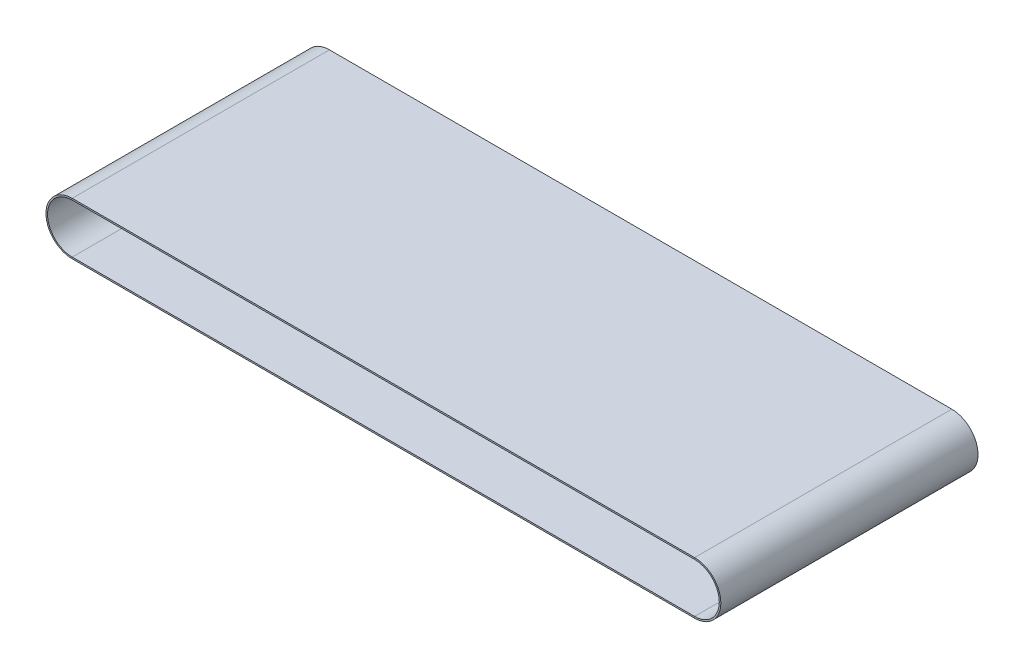
ISO-10303-21;
HEADER;
FILE_DESCRIPTION(('STEP AP214'),'2;1');
FILE_NAME('part.step','',(''),(''),'','','');
FILE_SCHEMA(('AUTOMOTIVE_DESIGN { 1 0 10303 214 1 1 1 1 }'));
ENDSEC;
DATA;
#1=APPLICATION_CONTEXT('core data for automotive mechanical design processes');
#2=APPLICATION_PROTOCOL_DEFINITION('international standard','automotive_design',2000,#1);
#3=PRODUCT_CONTEXT('',#1,'mechanical');
#4=PRODUCT('Part','Part','',(#3));
#5=PRODUCT_RELATED_PRODUCT_CATEGORY('part','',(#4));
#6=PRODUCT_DEFINITION_FORMATION('','',#4);
#7=PRODUCT_DEFINITION_CONTEXT('part definition',#1,'design');
#8=PRODUCT_DEFINITION('design','',#6,#7);
#9=PRODUCT_DEFINITION_SHAPE('','',#8);
#10=(LENGTH_UNIT() NAMED_UNIT(*) SI_UNIT(.MILLI.,.METRE.));
#11=(NAMED_UNIT(*) PLANE_ANGLE_UNIT() SI_UNIT($,.RADIAN.));
#12=(NAMED_UNIT(*) SI_UNIT($,.STERADIAN.) SOLID_ANGLE_UNIT());
#13=UNCERTAINTY_MEASURE_WITH_UNIT(LENGTH_MEASURE(1.E-05),#10,'distance_accuracy_value','');
#14=(GEOMETRIC_REPRESENTATION_CONTEXT(3) GLOBAL_UNCERTAINTY_ASSIGNED_CONTEXT((#13)) GLOBAL_UNIT_ASSIGNED_CONTEXT((#10,
#11,#12)) REPRESENTATION_CONTEXT('',''));
#15=CARTESIAN_POINT('',(0.,0.,0.));
#16=DIRECTION('',(0.,0.,1.));
#17=DIRECTION('',(1.,0.,0.));
#18=AXIS2_PLACEMENT_3D('',#15,#16,#17);
#19=CARTESIAN_POINT('',(-605.,0.,0.));
#20=DIRECTION('',(0.,0.,-1.));
#21=DIRECTION('',(-1.,0.,0.));
#22=AXIS2_PLACEMENT_3D('',#19,#20,#21);
#23=CYLINDRICAL_SURFACE('',#22,24.);
#24=CARTESIAN_POINT('',(-605.,0.,125.));
#25=DIRECTION('',(0.,0.,-1.));
#26=DIRECTION('',(0.,-1.,0.));
#27=AXIS2_PLACEMENT_3D('',#24,#25,#26);
#28=CIRCLE('',#27,24.);
#29=CARTESIAN_POINT('',(-605.,-24.,125.));
#30=VERTEX_POINT('',#29);
#31=CARTESIAN_POINT('',(-605.,24.,125.));
#32=VERTEX_POINT('',#31);
#33=EDGE_CURVE('E11',#30,#32,#28,.T.);
#34=ORIENTED_EDGE('',*,*,#33,.F.);
#35=DIRECTION('',(0.,0.,-1.));
#36=VECTOR('',#35,1.);
#37=CARTESIAN_POINT('',(-605.,-24.,125.));
#38=LINE('',#37,#36);
#39=CARTESIAN_POINT('',(-605.,-24.,-125.));
#40=VERTEX_POINT('',#39);
#41=EDGE_CURVE('E37',#30,#40,#38,.T.);
#42=ORIENTED_EDGE('',*,*,#41,.T.);
#43=CARTESIAN_POINT('',(-605.,0.,-125.));
#44=DIRECTION('',(0.,0.,-1.));
#45=DIRECTION('',(0.,-1.,0.));
#46=AXIS2_PLACEMENT_3D('',#43,#44,#45);
#47=CIRCLE('',#46,24.);
#48=CARTESIAN_POINT('',(-605.,24.,-125.));
#49=VERTEX_POINT('',#48);
#50=EDGE_CURVE('E122',#40,#49,#47,.T.);
#51=ORIENTED_EDGE('',*,*,#50,.T.);
#52=DIRECTION('',(0.,0.,-1.));
#53=VECTOR('',#52,1.);
#54=CARTESIAN_POINT('',(-605.,24.,125.));
#55=LINE('',#54,#53);
#56=EDGE_CURVE('E125',#32,#49,#55,.T.);
#57=ORIENTED_EDGE('',*,*,#56,.F.);
#58=EDGE_LOOP('',(#34,#42,#51,#57));
#59=FACE_BOUND('',#58,.T.);
#60=ADVANCED_FACE('F34',(#59),#23,.F.);
#61=CARTESIAN_POINT('',(-605.,-24.,125.));
#62=DIRECTION('',(0.,0.,1.));
#63=DIRECTION('',(1.,0.,0.));
#64=AXIS2_PLACEMENT_3D('',#61,#62,#63);
#65=PLANE('',#64);
#66=CARTESIAN_POINT('',(-605.,0.,125.));
#67=DIRECTION('',(0.,0.,-1.));
#68=DIRECTION('',(0.,-1.,0.));
#69=AXIS2_PLACEMENT_3D('',#66,#67,#68);
#70=CIRCLE('',#69,25.5);
#71=CARTESIAN_POINT('',(-605.,-25.5,125.));
#72=VERTEX_POINT('',#71);
#73=CARTESIAN_POINT('',(-605.,25.5,125.));
#74=VERTEX_POINT('',#73);
#75=EDGE_CURVE('E42',#72,#74,#70,.T.);
#76=ORIENTED_EDGE('',*,*,#75,.F.);
#77=DIRECTION('',(0.,1.,0.));
#78=VECTOR('',#77,1.);
#79=CARTESIAN_POINT('',(-605.,-24.,125.));
#80=LINE('',#79,#78);
#81=EDGE_CURVE('E192',#72,#30,#80,.T.);
#82=ORIENTED_EDGE('',*,*,#81,.T.);
#83=ORIENTED_EDGE('',*,*,#33,.T.);
#84=DIRECTION('',(0.,-1.,0.));
#85=VECTOR('',#84,1.);
#86=CARTESIAN_POINT('',(-605.,24.,125.));
#87=LINE('',#86,#85);
#88=EDGE_CURVE('E150',#74,#32,#87,.T.);
#89=ORIENTED_EDGE('',*,*,#88,.F.);
#90=EDGE_LOOP('',(#76,#82,#83,#89));
#91=FACE_BOUND('',#90,.T.);
#92=ADVANCED_FACE('F216',(#91),#65,.T.);
#93=CARTESIAN_POINT('',(-605.,0.,0.));
#94=DIRECTION('',(0.,0.,-1.));
#95=DIRECTION('',(-1.,0.,0.));
#96=AXIS2_PLACEMENT_3D('',#93,#94,#95);
#97=CYLINDRICAL_SURFACE('',#96,25.5);
#98=CARTESIAN_POINT('',(-605.,0.,-125.));
#99=DIRECTION('',(0.,0.,-1.));
#100=DIRECTION('',(0.,-1.,0.));
#101=AXIS2_PLACEMENT_3D('',#98,#99,#100);
#102=CIRCLE('',#101,25.5);
#103=CARTESIAN_POINT('',(-605.,-25.5,-125.));
#104=VERTEX_POINT('',#103);
#105=CARTESIAN_POINT('',(-605.,25.5,-125.));
#106=VERTEX_POINT('',#105);
#107=EDGE_CURVE('E131',#104,#106,#102,.T.);
#108=ORIENTED_EDGE('',*,*,#107,.F.);
#109=DIRECTION('',(0.,0.,1.));
#110=VECTOR('',#109,1.);
#111=CARTESIAN_POINT('',(-605.,-25.5,-125.));
#112=LINE('',#111,#110);
#113=EDGE_CURVE('E176',#104,#72,#112,.T.);
#114=ORIENTED_EDGE('',*,*,#113,.T.);
#115=ORIENTED_EDGE('',*,*,#75,.T.);
#116=DIRECTION('',(0.,0.,1.));
#117=VECTOR('',#116,1.);
#118=CARTESIAN_POINT('',(-605.,25.5,-125.));
#119=LINE('',#118,#117);
#120=EDGE_CURVE('E154',#106,#74,#119,.T.);
#121=ORIENTED_EDGE('',*,*,#120,.F.);
#122=EDGE_LOOP('',(#108,#114,#115,#121));
#123=FACE_BOUND('',#122,.T.);
#124=ADVANCED_FACE('F221',(#123),#97,.T.);
#125=CARTESIAN_POINT('',(0.,-24.,125.));
#126=DIRECTION('',(0.,1.,0.));
#127=DIRECTION('',(0.,0.,1.));
#128=AXIS2_PLACEMENT_3D('',#125,#126,#127);
#129=PLANE('',#128);
#130=ORIENTED_EDGE('',*,*,#41,.F.);
#131=DIRECTION('',(-1.,0.,0.));
#132=VECTOR('',#131,1.);
#133=CARTESIAN_POINT('',(0.,-24.,125.));
#134=LINE('',#133,#132);
#135=CARTESIAN_POINT('',(0.,-24.,125.));
#136=VERTEX_POINT('',#135);
#137=EDGE_CURVE('E78',#136,#30,#134,.T.);
#138=ORIENTED_EDGE('',*,*,#137,.F.);
#139=DIRECTION('',(0.,0.,-1.));
#140=VECTOR('',#139,1.);
#141=CARTESIAN_POINT('',(0.,-24.,125.));
#142=LINE('',#141,#140);
#143=CARTESIAN_POINT('',(0.,-24.,-125.));
#144=VERTEX_POINT('',#143);
#145=EDGE_CURVE('E179',#136,#144,#142,.T.);
#146=ORIENTED_EDGE('',*,*,#145,.T.);
#147=DIRECTION('',(-1.,0.,0.));
#148=VECTOR('',#147,1.);
#149=CARTESIAN_POINT('',(0.,-24.,-125.));
#150=LINE('',#149,#148);
#151=EDGE_CURVE('E174',#144,#40,#150,.T.);
#152=ORIENTED_EDGE('',*,*,#151,.T.);
#153=EDGE_LOOP('',(#130,#138,#146,#152));
#154=FACE_BOUND('',#153,.T.);
#155=ADVANCED_FACE('F205',(#154),#129,.T.);
#156=CARTESIAN_POINT('',(0.,-24.,125.));
#157=DIRECTION('',(0.,0.,1.));
#158=DIRECTION('',(1.,0.,0.));
#159=AXIS2_PLACEMENT_3D('',#156,#157,#158);
#160=PLANE('',#159);
#161=ORIENTED_EDGE('',*,*,#137,.T.);
#162=ORIENTED_EDGE('',*,*,#81,.F.);
#163=DIRECTION('',(-1.,0.,0.));
#164=VECTOR('',#163,1.);
#165=CARTESIAN_POINT('',(0.,-25.5,125.));
#166=LINE('',#165,#164);
#167=CARTESIAN_POINT('',(0.,-25.5,125.));
#168=VERTEX_POINT('',#167);
#169=EDGE_CURVE('E87',#168,#72,#166,.T.);
#170=ORIENTED_EDGE('',*,*,#169,.F.);
#171=DIRECTION('',(0.,1.,0.));
#172=VECTOR('',#171,1.);
#173=CARTESIAN_POINT('',(0.,-24.,125.));
#174=LINE('',#173,#172);
#175=EDGE_CURVE('E188',#168,#136,#174,.T.);
#176=ORIENTED_EDGE('',*,*,#175,.T.);
#177=EDGE_LOOP('',(#161,#162,#170,#176));
#178=FACE_BOUND('',#177,.T.);
#179=ADVANCED_FACE('F215',(#178),#160,.T.);
#180=CARTESIAN_POINT('',(0.,-25.5,-125.));
#181=DIRECTION('',(0.,-1.,0.));
#182=DIRECTION('',(0.,0.,-1.));
#183=AXIS2_PLACEMENT_3D('',#180,#181,#182);
#184=PLANE('',#183);
#185=ORIENTED_EDGE('',*,*,#169,.T.);
#186=ORIENTED_EDGE('',*,*,#113,.F.);
#187=DIRECTION('',(-1.,0.,0.));
#188=VECTOR('',#187,1.);
#189=CARTESIAN_POINT('',(0.,-25.5,-125.));
#190=LINE('',#189,#188);
#191=CARTESIAN_POINT('',(0.,-25.5,-125.));
#192=VERTEX_POINT('',#191);
#193=EDGE_CURVE('E95',#192,#104,#190,.T.);
#194=ORIENTED_EDGE('',*,*,#193,.F.);
#195=DIRECTION('',(0.,0.,1.));
#196=VECTOR('',#195,1.);
#197=CARTESIAN_POINT('',(0.,-25.5,-125.));
#198=LINE('',#197,#196);
#199=EDGE_CURVE('E168',#192,#168,#198,.T.);
#200=ORIENTED_EDGE('',*,*,#199,.T.);
#201=EDGE_LOOP('',(#185,#186,#194,#200));
#202=FACE_BOUND('',#201,.T.);
#203=ADVANCED_FACE('F222',(#202),#184,.T.);
#204=CARTESIAN_POINT('',(0.,-24.,-125.));
#205=DIRECTION('',(0.,0.,-1.));
#206=DIRECTION('',(-1.,0.,0.));
#207=AXIS2_PLACEMENT_3D('',#204,#205,#206);
#208=PLANE('',#207);
#209=ORIENTED_EDGE('',*,*,#193,.T.);
#210=DIRECTION('',(0.,-1.,0.));
#211=VECTOR('',#210,1.);
#212=CARTESIAN_POINT('',(-605.,-24.,-125.));
#213=LINE('',#212,#211);
#214=EDGE_CURVE('E172',#40,#104,#213,.T.);
#215=ORIENTED_EDGE('',*,*,#214,.F.);
#216=ORIENTED_EDGE('',*,*,#151,.F.);
#217=DIRECTION('',(0.,-1.,0.));
#218=VECTOR('',#217,1.);
#219=CARTESIAN_POINT('',(0.,-24.,-125.));
#220=LINE('',#219,#218);
#221=EDGE_CURVE('E163',#144,#192,#220,.T.);
#222=ORIENTED_EDGE('',*,*,#221,.T.);
#223=EDGE_LOOP('',(#209,#215,#216,#222));
#224=FACE_BOUND('',#223,.T.);
#225=ADVANCED_FACE('F223',(#224),#208,.T.);
#226=CARTESIAN_POINT('',(0.,0.,0.));
#227=DIRECTION('',(0.,0.,-1.));
#228=DIRECTION('',(-1.,0.,0.));
#229=AXIS2_PLACEMENT_3D('',#226,#227,#228);
#230=CYLINDRICAL_SURFACE('',#229,24.);
#231=ORIENTED_EDGE('',*,*,#145,.F.);
#232=CARTESIAN_POINT('',(0.,0.,125.));
#233=DIRECTION('',(0.,0.,-1.));
#234=DIRECTION('',(0.,1.,0.));
#235=AXIS2_PLACEMENT_3D('',#232,#233,#234);
#236=CIRCLE('',#235,24.);
#237=CARTESIAN_POINT('',(0.,24.,125.));
#238=VERTEX_POINT('',#237);
#239=EDGE_CURVE('E198',#238,#136,#236,.T.);
#240=ORIENTED_EDGE('',*,*,#239,.F.);
#241=DIRECTION('',(0.,0.,-1.));
#242=VECTOR('',#241,1.);
#243=CARTESIAN_POINT('',(0.,24.,125.));
#244=LINE('',#243,#242);
#245=CARTESIAN_POINT('',(0.,24.,-125.));
#246=VERTEX_POINT('',#245);
#247=EDGE_CURVE('E171',#238,#246,#244,.T.);
#248=ORIENTED_EDGE('',*,*,#247,.T.);
#249=CARTESIAN_POINT('',(0.,0.,-125.));
#250=DIRECTION('',(0.,0.,-1.));
#251=DIRECTION('',(0.,1.,0.));
#252=AXIS2_PLACEMENT_3D('',#249,#250,#251);
#253=CIRCLE('',#252,24.);
#254=EDGE_CURVE('E166',#246,#144,#253,.T.);
#255=ORIENTED_EDGE('',*,*,#254,.T.);
#256=EDGE_LOOP('',(#231,#240,#248,#255));
#257=FACE_BOUND('',#256,.T.);
#258=ADVANCED_FACE('F210',(#257),#230,.F.);
#259=CARTESIAN_POINT('',(0.,24.,125.));
#260=DIRECTION('',(0.,0.,1.));
#261=DIRECTION('',(1.,0.,0.));
#262=AXIS2_PLACEMENT_3D('',#259,#260,#261);
#263=PLANE('',#262);
#264=ORIENTED_EDGE('',*,*,#239,.T.);
#265=ORIENTED_EDGE('',*,*,#175,.F.);
#266=CARTESIAN_POINT('',(0.,0.,125.));
#267=DIRECTION('',(0.,0.,-1.));
#268=DIRECTION('',(0.,1.,0.));
#269=AXIS2_PLACEMENT_3D('',#266,#267,#268);
#270=CIRCLE('',#269,25.5);
#271=CARTESIAN_POINT('',(0.,25.5,125.));
#272=VERTEX_POINT('',#271);
#273=EDGE_CURVE('E107',#272,#168,#270,.T.);
#274=ORIENTED_EDGE('',*,*,#273,.F.);
#275=DIRECTION('',(0.,-1.,0.));
#276=VECTOR('',#275,1.);
#277=CARTESIAN_POINT('',(0.,24.,125.));
#278=LINE('',#277,#276);
#279=EDGE_CURVE('E185',#272,#238,#278,.T.);
#280=ORIENTED_EDGE('',*,*,#279,.T.);
#281=EDGE_LOOP('',(#264,#265,#274,#280));
#282=FACE_BOUND('',#281,.T.);
#283=ADVANCED_FACE('F214',(#282),#263,.T.);
#284=CARTESIAN_POINT('',(0.,0.,0.));
#285=DIRECTION('',(0.,0.,-1.));
#286=DIRECTION('',(-1.,0.,0.));
#287=AXIS2_PLACEMENT_3D('',#284,#285,#286);
#288=CYLINDRICAL_SURFACE('',#287,25.5);
#289=ORIENTED_EDGE('',*,*,#273,.T.);
#290=ORIENTED_EDGE('',*,*,#199,.F.);
#291=CARTESIAN_POINT('',(0.,0.,-125.));
#292=DIRECTION('',(0.,0.,-1.));
#293=DIRECTION('',(0.,1.,0.));
#294=AXIS2_PLACEMENT_3D('',#291,#292,#293);
#295=CIRCLE('',#294,25.5);
#296=CARTESIAN_POINT('',(0.,25.5,-125.));
#297=VERTEX_POINT('',#296);
#298=EDGE_CURVE('E113',#297,#192,#295,.T.);
#299=ORIENTED_EDGE('',*,*,#298,.F.);
#300=DIRECTION('',(0.,0.,1.));
#301=VECTOR('',#300,1.);
#302=CARTESIAN_POINT('',(0.,25.5,-125.));
#303=LINE('',#302,#301);
#304=EDGE_CURVE('E161',#297,#272,#303,.T.);
#305=ORIENTED_EDGE('',*,*,#304,.T.);
#306=EDGE_LOOP('',(#289,#290,#299,#305));
#307=FACE_BOUND('',#306,.T.);
#308=ADVANCED_FACE('F276',(#307),#288,.T.);
#309=CARTESIAN_POINT('',(0.,24.,-125.));
#310=DIRECTION('',(0.,0.,-1.));
#311=DIRECTION('',(-1.,0.,0.));
#312=AXIS2_PLACEMENT_3D('',#309,#310,#311);
#313=PLANE('',#312);
#314=ORIENTED_EDGE('',*,*,#298,.T.);
#315=ORIENTED_EDGE('',*,*,#221,.F.);
#316=ORIENTED_EDGE('',*,*,#254,.F.);
#317=DIRECTION('',(0.,1.,0.));
#318=VECTOR('',#317,1.);
#319=CARTESIAN_POINT('',(0.,24.,-125.));
#320=LINE('',#319,#318);
#321=EDGE_CURVE('E142',#246,#297,#320,.T.);
#322=ORIENTED_EDGE('',*,*,#321,.T.);
#323=EDGE_LOOP('',(#314,#315,#316,#322));
#324=FACE_BOUND('',#323,.T.);
#325=ADVANCED_FACE('F208',(#324),#313,.T.);
#326=CARTESIAN_POINT('',(-605.,24.,125.));
#327=DIRECTION('',(0.,-1.,0.));
#328=DIRECTION('',(0.,0.,-1.));
#329=AXIS2_PLACEMENT_3D('',#326,#327,#328);
#330=PLANE('',#329);
#331=ORIENTED_EDGE('',*,*,#247,.F.);
#332=DIRECTION('',(1.,0.,0.));
#333=VECTOR('',#332,1.);
#334=CARTESIAN_POINT('',(-605.,24.,125.));
#335=LINE('',#334,#333);
#336=EDGE_CURVE('E149',#32,#238,#335,.T.);
#337=ORIENTED_EDGE('',*,*,#336,.F.);
#338=ORIENTED_EDGE('',*,*,#56,.T.);
#339=DIRECTION('',(1.,0.,0.));
#340=VECTOR('',#339,1.);
#341=CARTESIAN_POINT('',(-605.,24.,-125.));
#342=LINE('',#341,#340);
#343=EDGE_CURVE('E137',#49,#246,#342,.T.);
#344=ORIENTED_EDGE('',*,*,#343,.T.);
#345=EDGE_LOOP('',(#331,#337,#338,#344));
#346=FACE_BOUND('',#345,.T.);
#347=ADVANCED_FACE('F147',(#346),#330,.T.);
#348=CARTESIAN_POINT('',(-605.,24.,125.));
#349=DIRECTION('',(0.,0.,1.));
#350=DIRECTION('',(1.,0.,0.));
#351=AXIS2_PLACEMENT_3D('',#348,#349,#350);
#352=PLANE('',#351);
#353=ORIENTED_EDGE('',*,*,#336,.T.);
#354=ORIENTED_EDGE('',*,*,#279,.F.);
#355=DIRECTION('',(1.,0.,0.));
#356=VECTOR('',#355,1.);
#357=CARTESIAN_POINT('',(-605.,25.5,125.));
#358=LINE('',#357,#356);
#359=EDGE_CURVE('E182',#74,#272,#358,.T.);
#360=ORIENTED_EDGE('',*,*,#359,.F.);
#361=ORIENTED_EDGE('',*,*,#88,.T.);
#362=EDGE_LOOP('',(#353,#354,#360,#361));
#363=FACE_BOUND('',#362,.T.);
#364=ADVANCED_FACE('F212',(#363),#352,.T.);
#365=CARTESIAN_POINT('',(-605.,25.5,-125.));
#366=DIRECTION('',(0.,1.,0.));
#367=DIRECTION('',(0.,0.,1.));
#368=AXIS2_PLACEMENT_3D('',#365,#366,#367);
#369=PLANE('',#368);
#370=ORIENTED_EDGE('',*,*,#359,.T.);
#371=ORIENTED_EDGE('',*,*,#304,.F.);
#372=DIRECTION('',(1.,0.,0.));
#373=VECTOR('',#372,1.);
#374=CARTESIAN_POINT('',(-605.,25.5,-125.));
#375=LINE('',#374,#373);
#376=EDGE_CURVE('E160',#106,#297,#375,.T.);
#377=ORIENTED_EDGE('',*,*,#376,.F.);
#378=ORIENTED_EDGE('',*,*,#120,.T.);
#379=EDGE_LOOP('',(#370,#371,#377,#378));
#380=FACE_BOUND('',#379,.T.);
#381=ADVANCED_FACE('F219',(#380),#369,.T.);
#382=CARTESIAN_POINT('',(-605.,24.,-125.));
#383=DIRECTION('',(0.,0.,-1.));
#384=DIRECTION('',(-1.,0.,0.));
#385=AXIS2_PLACEMENT_3D('',#382,#383,#384);
#386=PLANE('',#385);
#387=ORIENTED_EDGE('',*,*,#376,.T.);
#388=ORIENTED_EDGE('',*,*,#321,.F.);
#389=ORIENTED_EDGE('',*,*,#343,.F.);
#390=DIRECTION('',(0.,1.,0.));
#391=VECTOR('',#390,1.);
#392=CARTESIAN_POINT('',(-605.,24.,-125.));
#393=LINE('',#392,#391);
#394=EDGE_CURVE('E140',#49,#106,#393,.T.);
#395=ORIENTED_EDGE('',*,*,#394,.T.);
#396=EDGE_LOOP('',(#387,#388,#389,#395));
#397=FACE_BOUND('',#396,.T.);
#398=ADVANCED_FACE('F139',(#397),#386,.T.);
#399=CARTESIAN_POINT('',(-605.,-24.,-125.));
#400=DIRECTION('',(0.,0.,-1.));
#401=DIRECTION('',(-1.,0.,0.));
#402=AXIS2_PLACEMENT_3D('',#399,#400,#401);
#403=PLANE('',#402);
#404=ORIENTED_EDGE('',*,*,#214,.T.);
#405=ORIENTED_EDGE('',*,*,#107,.T.);
#406=ORIENTED_EDGE('',*,*,#394,.F.);
#407=ORIENTED_EDGE('',*,*,#50,.F.);
#408=EDGE_LOOP('',(#404,#405,#406,#407));
#409=FACE_BOUND('',#408,.T.);
#410=ADVANCED_FACE('F152',(#409),#403,.T.);
#411=CLOSED_SHELL('',(#60,#92,#124,#155,#179,#203,#225,#258,#283,#308,#325,#347,#364,#381,#398,#410));
#412=MANIFOLD_SOLID_BREP('B2',#411);
#413=ADVANCED_BREP_SHAPE_REPRESENTATION('',(#18,#412),#14);
#414=SHAPE_DEFINITION_REPRESENTATION(#9,#413);
ENDSEC;
END-ISO-10303-21;
